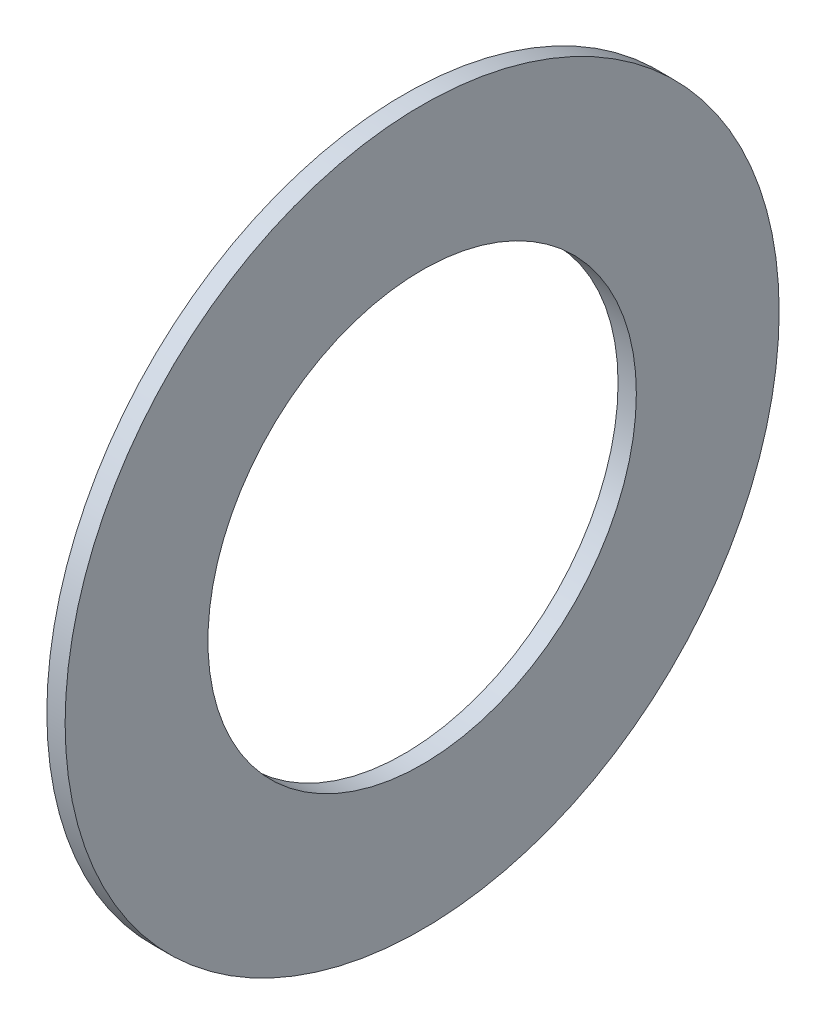
ISO-10303-21;
HEADER;
FILE_DESCRIPTION(('STEP AP214'),'2;1');
FILE_NAME('part.step','',(''),(''),'','','');
FILE_SCHEMA(('AUTOMOTIVE_DESIGN { 1 0 10303 214 1 1 1 1 }'));
ENDSEC;
DATA;
#1=APPLICATION_CONTEXT('core data for automotive mechanical design processes');
#2=APPLICATION_PROTOCOL_DEFINITION('international standard','automotive_design',2000,#1);
#3=PRODUCT_CONTEXT('',#1,'mechanical');
#4=PRODUCT('Part','Part','',(#3));
#5=PRODUCT_RELATED_PRODUCT_CATEGORY('part','',(#4));
#6=PRODUCT_DEFINITION_FORMATION('','',#4);
#7=PRODUCT_DEFINITION_CONTEXT('part definition',#1,'design');
#8=PRODUCT_DEFINITION('design','',#6,#7);
#9=PRODUCT_DEFINITION_SHAPE('','',#8);
#10=(LENGTH_UNIT() NAMED_UNIT(*) SI_UNIT(.MILLI.,.METRE.));
#11=(NAMED_UNIT(*) PLANE_ANGLE_UNIT() SI_UNIT($,.RADIAN.));
#12=(NAMED_UNIT(*) SI_UNIT($,.STERADIAN.) SOLID_ANGLE_UNIT());
#13=UNCERTAINTY_MEASURE_WITH_UNIT(LENGTH_MEASURE(1.E-05),#10,'distance_accuracy_value','');
#14=(GEOMETRIC_REPRESENTATION_CONTEXT(3) GLOBAL_UNCERTAINTY_ASSIGNED_CONTEXT((#13)) GLOBAL_UNIT_ASSIGNED_CONTEXT((#10,
#11,#12)) REPRESENTATION_CONTEXT('',''));
#15=CARTESIAN_POINT('',(0.,0.,0.));
#16=DIRECTION('',(0.,0.,1.));
#17=DIRECTION('',(1.,0.,0.));
#18=AXIS2_PLACEMENT_3D('',#15,#16,#17);
#19=CARTESIAN_POINT('',(0.8128,0.,0.));
#20=DIRECTION('',(1.,0.,0.));
#21=DIRECTION('',(0.,0.,-1.));
#22=AXIS2_PLACEMENT_3D('',#19,#20,#21);
#23=PLANE('',#22);
#24=CARTESIAN_POINT('',(0.8128,0.,0.));
#25=DIRECTION('',(1.,0.,0.));
#26=DIRECTION('',(0.,0.,-1.));
#27=AXIS2_PLACEMENT_3D('',#24,#25,#26);
#28=CIRCLE('',#27,15.875);
#29=CARTESIAN_POINT('',(0.8128,0.,-15.875));
#30=VERTEX_POINT('',#29);
#31=EDGE_CURVE('E10',#30,#30,#28,.T.);
#32=ORIENTED_EDGE('',*,*,#31,.T.);
#33=EDGE_LOOP('',(#32));
#34=FACE_BOUND('',#33,.T.);
#35=CARTESIAN_POINT('',(0.8128,0.,0.));
#36=DIRECTION('',(1.,0.,0.));
#37=DIRECTION('',(0.,0.,-1.));
#38=AXIS2_PLACEMENT_3D('',#35,#36,#37);
#39=CIRCLE('',#38,9.525);
#40=CARTESIAN_POINT('',(0.8128,0.,-9.525));
#41=VERTEX_POINT('',#40);
#42=EDGE_CURVE('E46',#41,#41,#39,.T.);
#43=ORIENTED_EDGE('',*,*,#42,.F.);
#44=EDGE_LOOP('',(#43));
#45=FACE_BOUND('',#44,.T.);
#46=ADVANCED_FACE('F35',(#34,#45),#23,.T.);
#47=CARTESIAN_POINT('',(0.,0.,0.));
#48=DIRECTION('',(1.,0.,0.));
#49=DIRECTION('',(0.,0.,-1.));
#50=AXIS2_PLACEMENT_3D('',#47,#48,#49);
#51=PLANE('',#50);
#52=CARTESIAN_POINT('',(0.,0.,0.));
#53=DIRECTION('',(1.,0.,0.));
#54=DIRECTION('',(0.,0.,-1.));
#55=AXIS2_PLACEMENT_3D('',#52,#53,#54);
#56=CIRCLE('',#55,15.875);
#57=CARTESIAN_POINT('',(0.,0.,-15.875));
#58=VERTEX_POINT('',#57);
#59=EDGE_CURVE('E42',#58,#58,#56,.T.);
#60=ORIENTED_EDGE('',*,*,#59,.F.);
#61=EDGE_LOOP('',(#60));
#62=FACE_BOUND('',#61,.T.);
#63=CARTESIAN_POINT('',(0.,0.,0.));
#64=DIRECTION('',(1.,0.,0.));
#65=DIRECTION('',(0.,0.,-1.));
#66=AXIS2_PLACEMENT_3D('',#63,#64,#65);
#67=CIRCLE('',#66,9.525);
#68=CARTESIAN_POINT('',(0.,0.,-9.525));
#69=VERTEX_POINT('',#68);
#70=EDGE_CURVE('E50',#69,#69,#67,.T.);
#71=ORIENTED_EDGE('',*,*,#70,.T.);
#72=EDGE_LOOP('',(#71));
#73=FACE_BOUND('',#72,.T.);
#74=ADVANCED_FACE('F56',(#62,#73),#51,.F.);
#75=CARTESIAN_POINT('',(0.8128,0.,0.));
#76=DIRECTION('',(-1.,0.,0.));
#77=DIRECTION('',(0.,0.,1.));
#78=AXIS2_PLACEMENT_3D('',#75,#76,#77);
#79=CYLINDRICAL_SURFACE('',#78,15.875);
#80=ORIENTED_EDGE('',*,*,#31,.F.);
#81=EDGE_LOOP('',(#80));
#82=FACE_BOUND('',#81,.T.);
#83=ORIENTED_EDGE('',*,*,#59,.T.);
#84=EDGE_LOOP('',(#83));
#85=FACE_BOUND('',#84,.T.);
#86=ADVANCED_FACE('F37',(#82,#85),#79,.T.);
#87=CARTESIAN_POINT('',(0.8128,0.,0.));
#88=DIRECTION('',(-1.,0.,0.));
#89=DIRECTION('',(0.,0.,1.));
#90=AXIS2_PLACEMENT_3D('',#87,#88,#89);
#91=CYLINDRICAL_SURFACE('',#90,9.525);
#92=ORIENTED_EDGE('',*,*,#42,.T.);
#93=EDGE_LOOP('',(#92));
#94=FACE_BOUND('',#93,.T.);
#95=ORIENTED_EDGE('',*,*,#70,.F.);
#96=EDGE_LOOP('',(#95));
#97=FACE_BOUND('',#96,.T.);
#98=ADVANCED_FACE('F58',(#94,#97),#91,.F.);
#99=CLOSED_SHELL('',(#46,#74,#86,#98));
#100=MANIFOLD_SOLID_BREP('B2',#99);
#101=ADVANCED_BREP_SHAPE_REPRESENTATION('',(#18,#100),#14);
#102=SHAPE_DEFINITION_REPRESENTATION(#9,#101);
ENDSEC;
END-ISO-10303-21;
